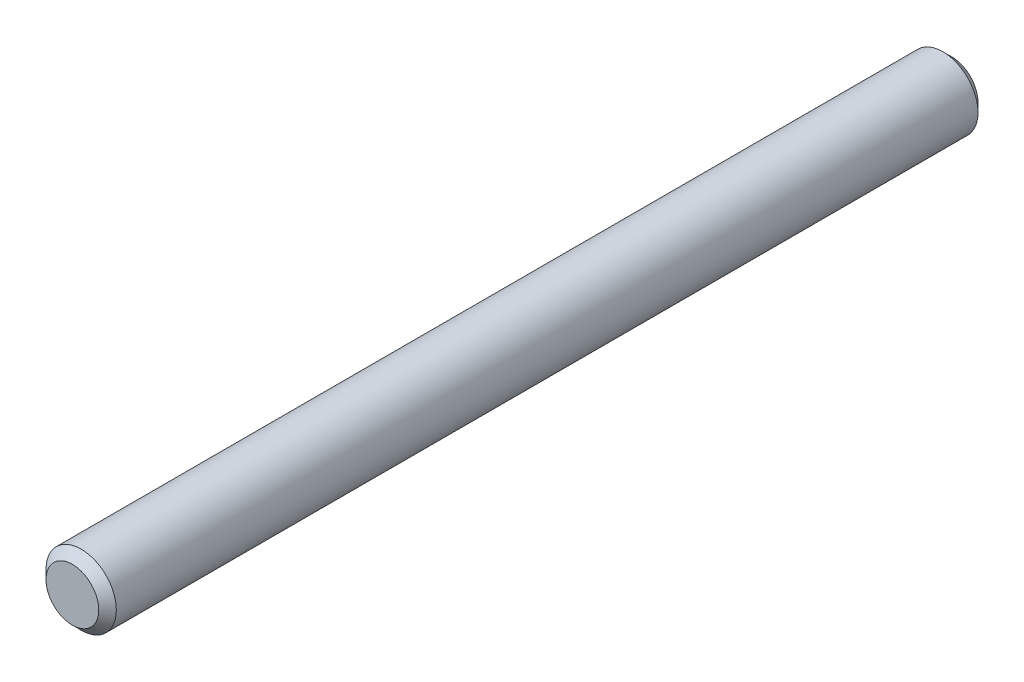
ISO-10303-21;
HEADER;
FILE_DESCRIPTION(('STEP AP214'),'2;1');
FILE_NAME('part.step','',(''),(''),'','','');
FILE_SCHEMA(('AUTOMOTIVE_DESIGN { 1 0 10303 214 1 1 1 1 }'));
ENDSEC;
DATA;
#1=APPLICATION_CONTEXT('core data for automotive mechanical design processes');
#2=APPLICATION_PROTOCOL_DEFINITION('international standard','automotive_design',2000,#1);
#3=PRODUCT_CONTEXT('',#1,'mechanical');
#4=PRODUCT('Part','Part','',(#3));
#5=PRODUCT_RELATED_PRODUCT_CATEGORY('part','',(#4));
#6=PRODUCT_DEFINITION_FORMATION('','',#4);
#7=PRODUCT_DEFINITION_CONTEXT('part definition',#1,'design');
#8=PRODUCT_DEFINITION('design','',#6,#7);
#9=PRODUCT_DEFINITION_SHAPE('','',#8);
#10=(LENGTH_UNIT() NAMED_UNIT(*) SI_UNIT(.MILLI.,.METRE.));
#11=(NAMED_UNIT(*) PLANE_ANGLE_UNIT() SI_UNIT($,.RADIAN.));
#12=(NAMED_UNIT(*) SI_UNIT($,.STERADIAN.) SOLID_ANGLE_UNIT());
#13=UNCERTAINTY_MEASURE_WITH_UNIT(LENGTH_MEASURE(1.E-05),#10,'distance_accuracy_value','');
#14=(GEOMETRIC_REPRESENTATION_CONTEXT(3) GLOBAL_UNCERTAINTY_ASSIGNED_CONTEXT((#13)) GLOBAL_UNIT_ASSIGNED_CONTEXT((#10,
#11,#12)) REPRESENTATION_CONTEXT('',''));
#15=CARTESIAN_POINT('',(0.,0.,0.));
#16=DIRECTION('',(0.,0.,1.));
#17=DIRECTION('',(1.,0.,0.));
#18=AXIS2_PLACEMENT_3D('',#15,#16,#17);
#19=CARTESIAN_POINT('',(0.,0.,25.));
#20=DIRECTION('',(0.,0.,-1.));
#21=DIRECTION('',(-1.,0.,0.));
#22=AXIS2_PLACEMENT_3D('',#19,#20,#21);
#23=CYLINDRICAL_SURFACE('',#22,2.);
#24=CARTESIAN_POINT('',(0.,0.,-24.5));
#25=DIRECTION('',(0.,0.,1.));
#26=DIRECTION('',(1.,0.,0.));
#27=AXIS2_PLACEMENT_3D('',#24,#25,#26);
#28=CIRCLE('',#27,2.);
#29=CARTESIAN_POINT('',(2.,0.,-24.5));
#30=VERTEX_POINT('',#29);
#31=EDGE_CURVE('E46',#30,#30,#28,.T.);
#32=ORIENTED_EDGE('',*,*,#31,.T.);
#33=EDGE_LOOP('',(#32));
#34=FACE_BOUND('',#33,.T.);
#35=CARTESIAN_POINT('',(0.,0.,24.5));
#36=DIRECTION('',(0.,0.,1.));
#37=DIRECTION('',(1.,0.,0.));
#38=AXIS2_PLACEMENT_3D('',#35,#36,#37);
#39=CIRCLE('',#38,2.);
#40=CARTESIAN_POINT('',(2.,0.,24.5));
#41=VERTEX_POINT('',#40);
#42=EDGE_CURVE('E50',#41,#41,#39,.F.);
#43=ORIENTED_EDGE('',*,*,#42,.T.);
#44=EDGE_LOOP('',(#43));
#45=FACE_BOUND('',#44,.T.);
#46=ADVANCED_FACE('F34',(#34,#45),#23,.T.);
#47=CARTESIAN_POINT('',(0.,0.,25.));
#48=DIRECTION('',(0.,0.,1.));
#49=DIRECTION('',(1.,0.,0.));
#50=AXIS2_PLACEMENT_3D('',#47,#48,#49);
#51=PLANE('',#50);
#52=CARTESIAN_POINT('',(0.,0.,25.));
#53=DIRECTION('',(0.,0.,1.));
#54=DIRECTION('',(1.,0.,0.));
#55=AXIS2_PLACEMENT_3D('',#52,#53,#54);
#56=CIRCLE('',#55,1.50000000000001);
#57=CARTESIAN_POINT('',(1.50000000000001,0.,25.));
#58=VERTEX_POINT('',#57);
#59=EDGE_CURVE('E10',#58,#58,#56,.T.);
#60=ORIENTED_EDGE('',*,*,#59,.T.);
#61=EDGE_LOOP('',(#60));
#62=FACE_BOUND('',#61,.T.);
#63=ADVANCED_FACE('F66',(#62),#51,.T.);
#64=CARTESIAN_POINT('',(0.,0.,-25.));
#65=DIRECTION('',(0.,0.,1.));
#66=DIRECTION('',(1.,0.,0.));
#67=AXIS2_PLACEMENT_3D('',#64,#65,#66);
#68=PLANE('',#67);
#69=CARTESIAN_POINT('',(0.,0.,-25.));
#70=DIRECTION('',(0.,0.,1.));
#71=DIRECTION('',(1.,0.,0.));
#72=AXIS2_PLACEMENT_3D('',#69,#70,#71);
#73=CIRCLE('',#72,1.49999999999999);
#74=CARTESIAN_POINT('',(1.49999999999999,0.,-25.));
#75=VERTEX_POINT('',#74);
#76=EDGE_CURVE('E42',#75,#75,#73,.F.);
#77=ORIENTED_EDGE('',*,*,#76,.T.);
#78=EDGE_LOOP('',(#77));
#79=FACE_BOUND('',#78,.T.);
#80=ADVANCED_FACE('F63',(#79),#68,.F.);
#81=CARTESIAN_POINT('',(0.,0.,-24.5));
#82=DIRECTION('',(0.,0.,1.));
#83=DIRECTION('',(1.,0.,0.));
#84=AXIS2_PLACEMENT_3D('',#81,#82,#83);
#85=CONICAL_SURFACE('',#84,2.,0.785398163397453);
#86=ORIENTED_EDGE('',*,*,#76,.F.);
#87=EDGE_LOOP('',(#86));
#88=FACE_BOUND('',#87,.T.);
#89=ORIENTED_EDGE('',*,*,#31,.F.);
#90=EDGE_LOOP('',(#89));
#91=FACE_BOUND('',#90,.T.);
#92=ADVANCED_FACE('F59',(#88,#91),#85,.T.);
#93=CARTESIAN_POINT('',(0.,0.,25.));
#94=DIRECTION('',(0.,0.,-1.));
#95=DIRECTION('',(-1.,0.,0.));
#96=AXIS2_PLACEMENT_3D('',#93,#94,#95);
#97=CONICAL_SURFACE('',#96,1.50000000000001,0.78539816339744);
#98=ORIENTED_EDGE('',*,*,#42,.F.);
#99=EDGE_LOOP('',(#98));
#100=FACE_BOUND('',#99,.T.);
#101=ORIENTED_EDGE('',*,*,#59,.F.);
#102=EDGE_LOOP('',(#101));
#103=FACE_BOUND('',#102,.T.);
#104=ADVANCED_FACE('F37',(#100,#103),#97,.T.);
#105=CLOSED_SHELL('',(#46,#63,#80,#92,#104));
#106=MANIFOLD_SOLID_BREP('B2',#105);
#107=ADVANCED_BREP_SHAPE_REPRESENTATION('',(#18,#106),#14);
#108=SHAPE_DEFINITION_REPRESENTATION(#9,#107);
ENDSEC;
END-ISO-10303-21;
